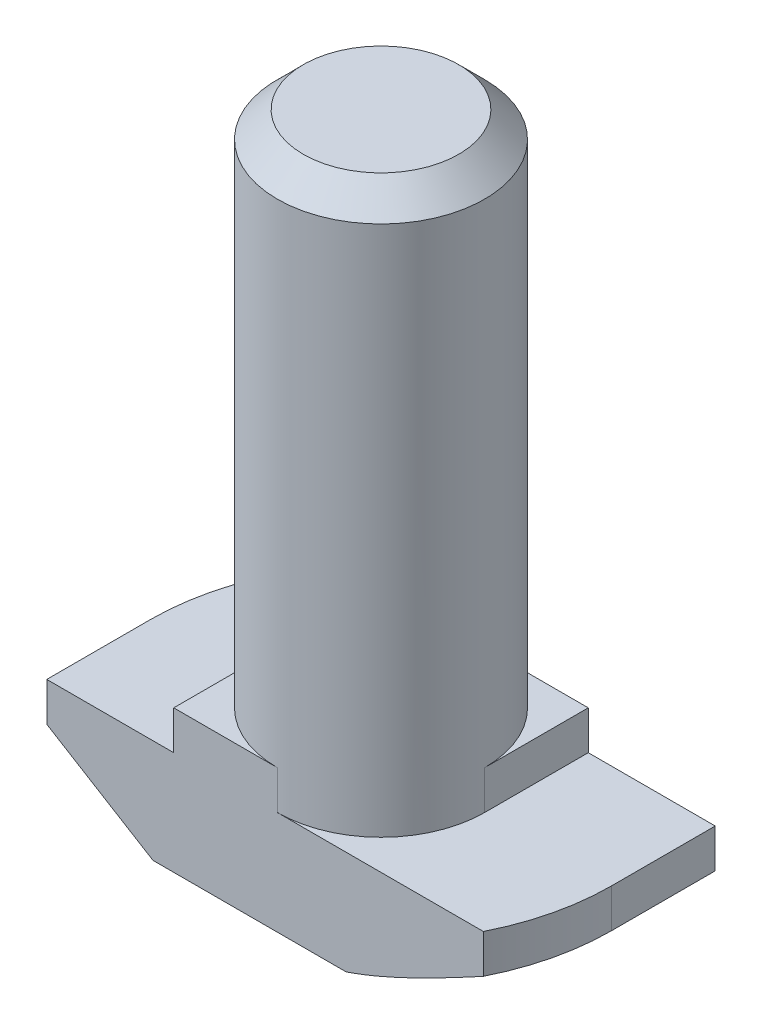
ISO-10303-21;
HEADER;
FILE_DESCRIPTION(('STEP AP214'),'2;1');
FILE_NAME('part.step','',(''),(''),'','','');
FILE_SCHEMA(('AUTOMOTIVE_DESIGN { 1 0 10303 214 1 1 1 1 }'));
ENDSEC;
DATA;
#1=APPLICATION_CONTEXT('core data for automotive mechanical design processes');
#2=APPLICATION_PROTOCOL_DEFINITION('international standard','automotive_design',2000,#1);
#3=PRODUCT_CONTEXT('',#1,'mechanical');
#4=PRODUCT('Part','Part','',(#3));
#5=PRODUCT_RELATED_PRODUCT_CATEGORY('part','',(#4));
#6=PRODUCT_DEFINITION_FORMATION('','',#4);
#7=PRODUCT_DEFINITION_CONTEXT('part definition',#1,'design');
#8=PRODUCT_DEFINITION('design','',#6,#7);
#9=PRODUCT_DEFINITION_SHAPE('','',#8);
#10=(LENGTH_UNIT() NAMED_UNIT(*) SI_UNIT(.MILLI.,.METRE.));
#11=(NAMED_UNIT(*) PLANE_ANGLE_UNIT() SI_UNIT($,.RADIAN.));
#12=(NAMED_UNIT(*) SI_UNIT($,.STERADIAN.) SOLID_ANGLE_UNIT());
#13=UNCERTAINTY_MEASURE_WITH_UNIT(LENGTH_MEASURE(1.E-05),#10,'distance_accuracy_value','');
#14=(GEOMETRIC_REPRESENTATION_CONTEXT(3) GLOBAL_UNCERTAINTY_ASSIGNED_CONTEXT((#13)) GLOBAL_UNIT_ASSIGNED_CONTEXT((#10,
#11,#12)) REPRESENTATION_CONTEXT('',''));
#15=CARTESIAN_POINT('',(0.,0.,0.));
#16=DIRECTION('',(0.,0.,1.));
#17=DIRECTION('',(1.,0.,0.));
#18=AXIS2_PLACEMENT_3D('',#15,#16,#17);
#19=CARTESIAN_POINT('',(-8.9,0.,4.));
#20=DIRECTION('',(1.,0.,0.));
#21=DIRECTION('',(0.,0.,-1.));
#22=AXIS2_PLACEMENT_3D('',#19,#20,#21);
#23=PLANE('',#22);
#24=DIRECTION('',(0.,0.,-1.));
#25=VECTOR('',#24,1.);
#26=CARTESIAN_POINT('',(-8.9,2.5,4.));
#27=LINE('',#26,#25);
#28=CARTESIAN_POINT('',(-8.9,2.5,4.));
#29=VERTEX_POINT('',#28);
#30=CARTESIAN_POINT('',(-8.9,2.5,0.));
#31=VERTEX_POINT('',#30);
#32=EDGE_CURVE('E369',#29,#31,#27,.T.);
#33=ORIENTED_EDGE('',*,*,#32,.F.);
#34=DIRECTION('',(0.,-1.,0.));
#35=VECTOR('',#34,1.);
#36=CARTESIAN_POINT('',(-8.9,0.,4.));
#37=LINE('',#36,#35);
#38=CARTESIAN_POINT('',(-8.9,4.,4.));
#39=VERTEX_POINT('',#38);
#40=EDGE_CURVE('E209',#39,#29,#37,.T.);
#41=ORIENTED_EDGE('',*,*,#40,.F.);
#42=DIRECTION('',(0.,0.,-1.));
#43=VECTOR('',#42,1.);
#44=CARTESIAN_POINT('',(-8.9,4.,4.));
#45=LINE('',#44,#43);
#46=CARTESIAN_POINT('',(-8.9,4.,0.));
#47=VERTEX_POINT('',#46);
#48=EDGE_CURVE('E224',#39,#47,#45,.T.);
#49=ORIENTED_EDGE('',*,*,#48,.T.);
#50=DIRECTION('',(0.,1.,0.));
#51=VECTOR('',#50,1.);
#52=CARTESIAN_POINT('',(-8.9,0.,0.));
#53=LINE('',#52,#51);
#54=EDGE_CURVE('E197',#31,#47,#53,.T.);
#55=ORIENTED_EDGE('',*,*,#54,.F.);
#56=EDGE_LOOP('',(#33,#41,#49,#55));
#57=FACE_BOUND('',#56,.T.);
#58=ADVANCED_FACE('F39',(#57),#23,.F.);
#59=CARTESIAN_POINT('',(8.9,0.,4.));
#60=DIRECTION('',(0.,1.,0.));
#61=DIRECTION('',(0.,0.,1.));
#62=AXIS2_PLACEMENT_3D('',#59,#60,#61);
#63=PLANE('',#62);
#64=DIRECTION('',(1.,0.,0.));
#65=VECTOR('',#64,1.);
#66=CARTESIAN_POINT('',(8.9,0.,4.));
#67=LINE('',#66,#65);
#68=CARTESIAN_POINT('',(-4.8,0.,4.));
#69=VERTEX_POINT('',#68);
#70=CARTESIAN_POINT('',(2.65329983228432,0.,4.));
#71=VERTEX_POINT('',#70);
#72=EDGE_CURVE('E212',#69,#71,#67,.T.);
#73=ORIENTED_EDGE('',*,*,#72,.F.);
#74=DIRECTION('',(0.,0.,-1.));
#75=VECTOR('',#74,1.);
#76=CARTESIAN_POINT('',(-4.8,0.,4.));
#77=LINE('',#76,#75);
#78=CARTESIAN_POINT('',(-4.8,0.,0.));
#79=VERTEX_POINT('',#78);
#80=EDGE_CURVE('E367',#69,#79,#77,.T.);
#81=ORIENTED_EDGE('',*,*,#80,.T.);
#82=CARTESIAN_POINT('',(0.,0.,0.));
#83=DIRECTION('',(0.,-1.,0.));
#84=DIRECTION('',(-1.,0.,0.));
#85=AXIS2_PLACEMENT_3D('',#82,#83,#84);
#86=CIRCLE('',#85,4.8);
#87=CARTESIAN_POINT('',(-2.65329983228432,0.,-4.));
#88=VERTEX_POINT('',#87);
#89=EDGE_CURVE('E366',#79,#88,#86,.T.);
#90=ORIENTED_EDGE('',*,*,#89,.T.);
#91=DIRECTION('',(1.,0.,0.));
#92=VECTOR('',#91,1.);
#93=CARTESIAN_POINT('',(8.9,0.,-4.));
#94=LINE('',#93,#92);
#95=CARTESIAN_POINT('',(4.8,0.,-4.));
#96=VERTEX_POINT('',#95);
#97=EDGE_CURVE('E208',#88,#96,#94,.T.);
#98=ORIENTED_EDGE('',*,*,#97,.T.);
#99=DIRECTION('',(0.,0.,1.));
#100=VECTOR('',#99,1.);
#101=CARTESIAN_POINT('',(4.8,0.,-8.9));
#102=LINE('',#101,#100);
#103=CARTESIAN_POINT('',(4.8,0.,0.));
#104=VERTEX_POINT('',#103);
#105=EDGE_CURVE('E55',#96,#104,#102,.T.);
#106=ORIENTED_EDGE('',*,*,#105,.T.);
#107=CARTESIAN_POINT('',(0.,0.,0.));
#108=DIRECTION('',(0.,-1.,0.));
#109=DIRECTION('',(1.,0.,0.));
#110=AXIS2_PLACEMENT_3D('',#107,#108,#109);
#111=CIRCLE('',#110,4.8);
#112=EDGE_CURVE('E155',#104,#71,#111,.T.);
#113=ORIENTED_EDGE('',*,*,#112,.T.);
#114=EDGE_LOOP('',(#73,#81,#90,#98,#106,#113));
#115=FACE_BOUND('',#114,.T.);
#116=ADVANCED_FACE('F270',(#115),#63,.F.);
#117=CARTESIAN_POINT('',(8.9,0.,4.));
#118=DIRECTION('',(-1.,0.,0.));
#119=DIRECTION('',(0.,0.,1.));
#120=AXIS2_PLACEMENT_3D('',#117,#118,#119);
#121=PLANE('',#120);
#122=DIRECTION('',(0.,0.,1.));
#123=VECTOR('',#122,1.);
#124=CARTESIAN_POINT('',(8.9,2.5,-8.9));
#125=LINE('',#124,#123);
#126=CARTESIAN_POINT('',(8.9,2.5,-4.));
#127=VERTEX_POINT('',#126);
#128=CARTESIAN_POINT('',(8.9,2.5,0.));
#129=VERTEX_POINT('',#128);
#130=EDGE_CURVE('E147',#127,#129,#125,.T.);
#131=ORIENTED_EDGE('',*,*,#130,.F.);
#132=DIRECTION('',(0.,1.,0.));
#133=VECTOR('',#132,1.);
#134=CARTESIAN_POINT('',(8.9,0.,-4.));
#135=LINE('',#134,#133);
#136=CARTESIAN_POINT('',(8.9,4.,-4.));
#137=VERTEX_POINT('',#136);
#138=EDGE_CURVE('E227',#127,#137,#135,.T.);
#139=ORIENTED_EDGE('',*,*,#138,.T.);
#140=DIRECTION('',(0.,0.,-1.));
#141=VECTOR('',#140,1.);
#142=CARTESIAN_POINT('',(8.9,4.,4.));
#143=LINE('',#142,#141);
#144=CARTESIAN_POINT('',(8.9,4.,0.));
#145=VERTEX_POINT('',#144);
#146=EDGE_CURVE('E175',#145,#137,#143,.T.);
#147=ORIENTED_EDGE('',*,*,#146,.F.);
#148=DIRECTION('',(0.,1.,0.));
#149=VECTOR('',#148,1.);
#150=CARTESIAN_POINT('',(8.9,0.,0.));
#151=LINE('',#150,#149);
#152=EDGE_CURVE('E168',#129,#145,#151,.T.);
#153=ORIENTED_EDGE('',*,*,#152,.F.);
#154=EDGE_LOOP('',(#131,#139,#147,#153));
#155=FACE_BOUND('',#154,.T.);
#156=ADVANCED_FACE('F173',(#155),#121,.F.);
#157=CARTESIAN_POINT('',(0.,0.,4.));
#158=DIRECTION('',(0.,0.,-1.));
#159=DIRECTION('',(-1.,0.,0.));
#160=AXIS2_PLACEMENT_3D('',#157,#158,#159);
#161=PLANE('',#160);
#162=DIRECTION('',(-0.853796175794036,0.520607424264656,0.));
#163=VECTOR('',#162,1.);
#164=CARTESIAN_POINT('',(-8.9,2.5,4.));
#165=LINE('',#164,#163);
#166=EDGE_CURVE('E375',#69,#29,#165,.T.);
#167=ORIENTED_EDGE('',*,*,#166,.F.);
#168=ORIENTED_EDGE('',*,*,#72,.T.);
#169=CARTESIAN_POINT('',(7.95117168412038,2.5003812948523,4.));
#170=CARTESIAN_POINT('',(7.73552594180779,2.38294262104349,4.));
#171=CARTESIAN_POINT('',(7.51949196287052,2.26620761305275,4.));
#172=CARTESIAN_POINT('',(7.08640702943254,2.03458295404349,4.));
#173=CARTESIAN_POINT('',(6.86935596494317,1.91969350884632,4.));
#174=CARTESIAN_POINT('',(6.43326841812792,1.6918189237928,4.));
#175=CARTESIAN_POINT('',(6.21422761700308,1.57884202880893,4.));
#176=CARTESIAN_POINT('',(5.77463734455681,1.3558784061402,4.));
#177=CARTESIAN_POINT('',(5.55408794028136,1.24589154663778,4.));
#178=CARTESIAN_POINT('',(5.11647910281973,1.03243373636638,4.));
#179=CARTESIAN_POINT('',(4.89946541196746,0.92886934419743,4.));
#180=CARTESIAN_POINT('',(4.46314517755054,0.726599943828819,4.));
#181=CARTESIAN_POINT('',(4.24383839666258,0.627895444761259,4.));
#182=CARTESIAN_POINT('',(3.80261128872497,0.437105119516572,4.));
#183=CARTESIAN_POINT('',(3.5806938708347,0.345012613183118,4.));
#184=CARTESIAN_POINT('',(3.13341004119999,0.169681531704238,4.));
#185=CARTESIAN_POINT('',(2.90804453781551,0.0864406691133928,4.));
#186=CARTESIAN_POINT('',(2.46564049107812,-0.0637337384147157,4.));
#187=CARTESIAN_POINT('',(2.24882314531661,-0.131311270143758,4.));
#188=CARTESIAN_POINT('',(1.81134539093152,-0.252017085141675,4.));
#189=CARTESIAN_POINT('',(1.59068966949939,-0.305161832872051,4.));
#190=CARTESIAN_POINT('',(1.25578974895032,-0.37125386899099,4.));
#191=CARTESIAN_POINT('',(1.1428915032614,-0.391082257285261,4.));
#192=CARTESIAN_POINT('',(0.916303642162891,-0.425522742673794,4.));
#193=CARTESIAN_POINT('',(0.802614110911478,-0.440135386106777,4.));
#194=CARTESIAN_POINT('',(0.574171741878051,-0.463762938801405,4.));
#195=CARTESIAN_POINT('',(0.459416448807066,-0.472754337723224,4.));
#196=CARTESIAN_POINT('',(0.229544837125645,-0.484799371089924,4.));
#197=CARTESIAN_POINT('',(0.11442837922421,-0.487850330163754,4.));
#198=CARTESIAN_POINT('',(-0.000700000000000364,-0.487804840701222,4.));
#199=B_SPLINE_CURVE_WITH_KNOTS('',3,(#169,#170,#171,#172,#173,#174,#175,#176,#177,#178,#179,
#180,#181,#182,#183,#184,#185,#186,#187,#188,#189,#190,#191,#192,#193,#194,#195,#196,#197,#198),
.UNSPECIFIED.,.F.,.F.,(4,2,2,2,2,2,2,2,2,2,2,2,2,2,4),(0.,0.73665607857229,1.47339374819651,
2.212756769811,2.95208714311461,3.6734194697194,4.39482720444832,5.11549552795205,
5.83597716113291,6.51694414905028,7.19713101684283,7.54090798827143,7.88464893918285,
8.22981810256985,8.57514268242548),.UNSPECIFIED.);
#200=CARTESIAN_POINT('',(7.95047168412038,2.5,4.));
#201=VERTEX_POINT('',#200);
#202=EDGE_CURVE('E319',#201,#71,#199,.T.);
#203=ORIENTED_EDGE('',*,*,#202,.F.);
#204=DIRECTION('',(0.,1.,0.));
#205=VECTOR('',#204,1.);
#206=CARTESIAN_POINT('',(7.95047168412038,0.,4.));
#207=LINE('',#206,#205);
#208=CARTESIAN_POINT('',(7.95047168412038,4.,4.));
#209=VERTEX_POINT('',#208);
#210=EDGE_CURVE('E170',#201,#209,#207,.T.);
#211=ORIENTED_EDGE('',*,*,#210,.T.);
#212=DIRECTION('',(-1.,0.,0.));
#213=VECTOR('',#212,1.);
#214=CARTESIAN_POINT('',(8.9,4.,4.));
#215=LINE('',#214,#213);
#216=CARTESIAN_POINT('',(0.,4.,4.));
#217=VERTEX_POINT('',#216);
#218=EDGE_CURVE('E216',#209,#217,#215,.T.);
#219=ORIENTED_EDGE('',*,*,#218,.T.);
#220=DIRECTION('',(0.,1.,0.));
#221=VECTOR('',#220,1.);
#222=CARTESIAN_POINT('',(0.,-1.65685424949238,4.));
#223=LINE('',#222,#221);
#224=CARTESIAN_POINT('',(0.,5.5,4.));
#225=VERTEX_POINT('',#224);
#226=EDGE_CURVE('E193',#217,#225,#223,.T.);
#227=ORIENTED_EDGE('',*,*,#226,.T.);
#228=DIRECTION('',(-1.,0.,0.));
#229=VECTOR('',#228,1.);
#230=CARTESIAN_POINT('',(-4.,5.5,4.));
#231=LINE('',#230,#229);
#232=CARTESIAN_POINT('',(-4.,5.5,4.));
#233=VERTEX_POINT('',#232);
#234=EDGE_CURVE('E218',#225,#233,#231,.T.);
#235=ORIENTED_EDGE('',*,*,#234,.T.);
#236=DIRECTION('',(0.,-1.,0.));
#237=VECTOR('',#236,1.);
#238=CARTESIAN_POINT('',(-4.,4.,4.));
#239=LINE('',#238,#237);
#240=CARTESIAN_POINT('',(-4.,4.,4.));
#241=VERTEX_POINT('',#240);
#242=EDGE_CURVE('E220',#233,#241,#239,.T.);
#243=ORIENTED_EDGE('',*,*,#242,.T.);
#244=DIRECTION('',(-1.,0.,0.));
#245=VECTOR('',#244,1.);
#246=CARTESIAN_POINT('',(-8.9,4.,4.));
#247=LINE('',#246,#245);
#248=EDGE_CURVE('E222',#241,#39,#247,.T.);
#249=ORIENTED_EDGE('',*,*,#248,.T.);
#250=ORIENTED_EDGE('',*,*,#40,.T.);
#251=EDGE_LOOP('',(#167,#168,#203,#211,#219,#227,#235,#243,#249,#250));
#252=FACE_BOUND('',#251,.T.);
#253=ADVANCED_FACE('F281',(#252),#161,.F.);
#254=CARTESIAN_POINT('',(0.,0.,-4.));
#255=DIRECTION('',(0.,0.,-1.));
#256=DIRECTION('',(-1.,0.,0.));
#257=AXIS2_PLACEMENT_3D('',#254,#255,#256);
#258=PLANE('',#257);
#259=ORIENTED_EDGE('',*,*,#97,.F.);
#260=CARTESIAN_POINT('',(0.000700000000000375,-0.487804840701222,-4.));
#261=CARTESIAN_POINT('',(-0.0911783891396318,-0.48782848460975,-4.));
#262=CARTESIAN_POINT('',(-0.183052746172593,-0.485894534221646,-4.));
#263=CARTESIAN_POINT('',(-0.366624394777082,-0.478214110158694,-4.));
#264=CARTESIAN_POINT('',(-0.458321717815279,-0.472468391698149,-4.));
#265=CARTESIAN_POINT('',(-0.641197389589646,-0.457284413495929,-4.));
#266=CARTESIAN_POINT('',(-0.732376445680467,-0.447854631312074,-4.));
#267=CARTESIAN_POINT('',(-0.914302231773763,-0.425490539884402,-4.));
#268=CARTESIAN_POINT('',(-1.00504894282095,-0.41255607839799,-4.));
#269=CARTESIAN_POINT('',(-1.27475669839242,-0.369111241216707,-4.));
#270=CARTESIAN_POINT('',(-1.45295798960378,-0.333803642672856,-4.));
#271=CARTESIAN_POINT('',(-1.80688694554488,-0.252374259841994,-4.));
#272=CARTESIAN_POINT('',(-1.98261350049563,-0.206247777936689,-4.));
#273=CARTESIAN_POINT('',(-2.40843477616905,-0.0830176290147687,-4.));
#274=CARTESIAN_POINT('',(-2.65716286909735,-0.00122224492027907,-4.));
#275=CARTESIAN_POINT('',(-3.1500236667871,0.175317023068226,-4.));
#276=CARTESIAN_POINT('',(-3.39415374276215,0.270068072754652,-4.));
#277=CARTESIAN_POINT('',(-3.87928874246701,0.469058436828284,-4.));
#278=CARTESIAN_POINT('',(-4.12028285320838,0.573323871149427,-4.));
#279=CARTESIAN_POINT('',(-4.59919632282166,0.788504405818799,-4.));
#280=CARTESIAN_POINT('',(-4.83711633279242,0.899418069039211,-4.));
#281=CARTESIAN_POINT('',(-5.31822851183188,1.1297988974704,-4.));
#282=CARTESIAN_POINT('',(-5.56134348218909,1.24942652452964,-4.));
#283=CARTESIAN_POINT('',(-6.045636996258,1.49257282867588,-4.));
#284=CARTESIAN_POINT('',(-6.28681538137222,1.61609182045058,-4.));
#285=CARTESIAN_POINT('',(-6.76588702271679,1.86515627626158,-4.));
#286=CARTESIAN_POINT('',(-7.0037914098582,1.99068039524177,-4.));
#287=CARTESIAN_POINT('',(-7.47834127800901,2.24398618358021,-4.));
#288=CARTESIAN_POINT('',(-7.71498697875761,2.37176744085524,-4.));
#289=CARTESIAN_POINT('',(-7.95117168412038,2.50038129485229,-4.));
#290=B_SPLINE_CURVE_WITH_KNOTS('',3,(#260,#261,#262,#263,#264,#265,#266,#267,#268,#269,#270,
#271,#272,#273,#274,#275,#276,#277,#278,#279,#280,#281,#282,#283,#284,#285,#286,#287,#288,#289),
.UNSPECIFIED.,.F.,.F.,(4,2,2,2,2,2,2,2,2,2,2,2,2,2,4),(0.,0.275607667670162,0.551160746311937,
0.82608343769266,1.10101807357745,1.64556230190507,2.19034341346489,2.97528858833922,
3.76066968678114,4.54827578228531,5.33571223306797,6.14852584679743,6.96140536089395,
7.76835733370051,8.57516347444109),.UNSPECIFIED.);
#291=CARTESIAN_POINT('',(-7.95047168412038,2.5,-4.));
#292=VERTEX_POINT('',#291);
#293=EDGE_CURVE('E313',#88,#292,#290,.T.);
#294=ORIENTED_EDGE('',*,*,#293,.T.);
#295=DIRECTION('',(0.,1.,0.));
#296=VECTOR('',#295,1.);
#297=CARTESIAN_POINT('',(-7.95047168412038,0.,-4.));
#298=LINE('',#297,#296);
#299=CARTESIAN_POINT('',(-7.95047168412038,4.,-4.));
#300=VERTEX_POINT('',#299);
#301=EDGE_CURVE('E179',#292,#300,#298,.T.);
#302=ORIENTED_EDGE('',*,*,#301,.T.);
#303=DIRECTION('',(-1.,0.,0.));
#304=VECTOR('',#303,1.);
#305=CARTESIAN_POINT('',(-8.9,4.,-4.));
#306=LINE('',#305,#304);
#307=CARTESIAN_POINT('',(0.,4.,-4.));
#308=VERTEX_POINT('',#307);
#309=EDGE_CURVE('E213',#308,#300,#306,.T.);
#310=ORIENTED_EDGE('',*,*,#309,.F.);
#311=DIRECTION('',(0.,1.,0.));
#312=VECTOR('',#311,1.);
#313=CARTESIAN_POINT('',(0.,-1.65685424949238,-4.));
#314=LINE('',#313,#312);
#315=CARTESIAN_POINT('',(0.,5.5,-4.));
#316=VERTEX_POINT('',#315);
#317=EDGE_CURVE('E204',#308,#316,#314,.T.);
#318=ORIENTED_EDGE('',*,*,#317,.T.);
#319=DIRECTION('',(-1.,0.,0.));
#320=VECTOR('',#319,1.);
#321=CARTESIAN_POINT('',(-4.,5.5,-4.));
#322=LINE('',#321,#320);
#323=CARTESIAN_POINT('',(4.,5.5,-4.));
#324=VERTEX_POINT('',#323);
#325=EDGE_CURVE('E235',#324,#316,#322,.T.);
#326=ORIENTED_EDGE('',*,*,#325,.F.);
#327=DIRECTION('',(0.,1.,0.));
#328=VECTOR('',#327,1.);
#329=CARTESIAN_POINT('',(4.,4.,-4.));
#330=LINE('',#329,#328);
#331=CARTESIAN_POINT('',(4.,4.,-4.));
#332=VERTEX_POINT('',#331);
#333=EDGE_CURVE('E232',#332,#324,#330,.T.);
#334=ORIENTED_EDGE('',*,*,#333,.F.);
#335=DIRECTION('',(-1.,0.,0.));
#336=VECTOR('',#335,1.);
#337=CARTESIAN_POINT('',(8.9,4.,-4.));
#338=LINE('',#337,#336);
#339=EDGE_CURVE('E229',#137,#332,#338,.T.);
#340=ORIENTED_EDGE('',*,*,#339,.F.);
#341=ORIENTED_EDGE('',*,*,#138,.F.);
#342=DIRECTION('',(-0.853796175794036,-0.520607424264656,0.));
#343=VECTOR('',#342,1.);
#344=CARTESIAN_POINT('',(1.3009540329575,-2.13356461405031,-4.));
#345=LINE('',#344,#343);
#346=EDGE_CURVE('E151',#127,#96,#345,.T.);
#347=ORIENTED_EDGE('',*,*,#346,.T.);
#348=EDGE_LOOP('',(#259,#294,#302,#310,#318,#326,#334,#340,#341,#347));
#349=FACE_BOUND('',#348,.T.);
#350=ADVANCED_FACE('F304',(#349),#258,.T.);
#351=CARTESIAN_POINT('',(0.,0.,0.));
#352=DIRECTION('',(0.,1.,0.));
#353=DIRECTION('',(0.,0.,1.));
#354=AXIS2_PLACEMENT_3D('',#351,#352,#353);
#355=CYLINDRICAL_SURFACE('',#354,8.9);
#356=CARTESIAN_POINT('',(0.,2.5,0.));
#357=DIRECTION('',(0.,-1.,0.));
#358=DIRECTION('',(-1.,0.,0.));
#359=AXIS2_PLACEMENT_3D('',#356,#357,#358);
#360=CIRCLE('',#359,8.9);
#361=EDGE_CURVE('E63',#31,#292,#360,.T.);
#362=ORIENTED_EDGE('',*,*,#361,.F.);
#363=ORIENTED_EDGE('',*,*,#54,.T.);
#364=CARTESIAN_POINT('',(0.,4.,0.));
#365=DIRECTION('',(0.,-1.,0.));
#366=DIRECTION('',(0.,0.,-1.));
#367=AXIS2_PLACEMENT_3D('',#364,#365,#366);
#368=CIRCLE('',#367,8.9);
#369=EDGE_CURVE('E176',#47,#300,#368,.T.);
#370=ORIENTED_EDGE('',*,*,#369,.T.);
#371=ORIENTED_EDGE('',*,*,#301,.F.);
#372=EDGE_LOOP('',(#362,#363,#370,#371));
#373=FACE_BOUND('',#372,.T.);
#374=ADVANCED_FACE('F308',(#373),#355,.T.);
#375=CARTESIAN_POINT('',(0.,0.,0.));
#376=DIRECTION('',(0.,1.,0.));
#377=DIRECTION('',(0.,0.,1.));
#378=AXIS2_PLACEMENT_3D('',#375,#376,#377);
#379=CYLINDRICAL_SURFACE('',#378,8.9);
#380=CARTESIAN_POINT('',(0.,2.5,0.));
#381=DIRECTION('',(0.,-1.,0.));
#382=DIRECTION('',(1.,0.,0.));
#383=AXIS2_PLACEMENT_3D('',#380,#381,#382);
#384=CIRCLE('',#383,8.9);
#385=EDGE_CURVE('E160',#129,#201,#384,.T.);
#386=ORIENTED_EDGE('',*,*,#385,.F.);
#387=ORIENTED_EDGE('',*,*,#152,.T.);
#388=CARTESIAN_POINT('',(0.,4.,0.));
#389=DIRECTION('',(0.,-1.,0.));
#390=DIRECTION('',(0.,0.,-1.));
#391=AXIS2_PLACEMENT_3D('',#388,#389,#390);
#392=CIRCLE('',#391,8.9);
#393=EDGE_CURVE('E181',#145,#209,#392,.T.);
#394=ORIENTED_EDGE('',*,*,#393,.T.);
#395=ORIENTED_EDGE('',*,*,#210,.F.);
#396=EDGE_LOOP('',(#386,#387,#394,#395));
#397=FACE_BOUND('',#396,.T.);
#398=ADVANCED_FACE('F166',(#397),#379,.T.);
#399=CARTESIAN_POINT('',(-4.,5.5,4.));
#400=DIRECTION('',(0.,-1.,0.));
#401=DIRECTION('',(0.,0.,-1.));
#402=AXIS2_PLACEMENT_3D('',#399,#400,#401);
#403=PLANE('',#402);
#404=CARTESIAN_POINT('',(0.,5.5,0.));
#405=DIRECTION('',(0.,1.,0.));
#406=DIRECTION('',(0.,0.,1.));
#407=AXIS2_PLACEMENT_3D('',#404,#405,#406);
#408=CIRCLE('',#407,4.);
#409=CARTESIAN_POINT('',(4.,5.5,0.));
#410=VERTEX_POINT('',#409);
#411=EDGE_CURVE('E186',#410,#316,#408,.T.);
#412=ORIENTED_EDGE('',*,*,#411,.F.);
#413=DIRECTION('',(0.,0.,-1.));
#414=VECTOR('',#413,1.);
#415=CARTESIAN_POINT('',(4.,5.5,4.));
#416=LINE('',#415,#414);
#417=EDGE_CURVE('E248',#410,#324,#416,.T.);
#418=ORIENTED_EDGE('',*,*,#417,.T.);
#419=ORIENTED_EDGE('',*,*,#325,.T.);
#420=EDGE_LOOP('',(#412,#418,#419));
#421=FACE_BOUND('',#420,.T.);
#422=ADVANCED_FACE('F294',(#421),#403,.F.);
#423=CARTESIAN_POINT('',(-4.,5.5,0.));
#424=VERTEX_POINT('',#423);
#425=EDGE_CURVE('E189',#424,#225,#408,.T.);
#426=ORIENTED_EDGE('',*,*,#425,.F.);
#427=DIRECTION('',(0.,0.,-1.));
#428=VECTOR('',#427,1.);
#429=CARTESIAN_POINT('',(-4.,5.5,4.));
#430=LINE('',#429,#428);
#431=EDGE_CURVE('E245',#233,#424,#430,.T.);
#432=ORIENTED_EDGE('',*,*,#431,.F.);
#433=ORIENTED_EDGE('',*,*,#234,.F.);
#434=EDGE_LOOP('',(#426,#432,#433));
#435=FACE_BOUND('',#434,.T.);
#436=ADVANCED_FACE('F286',(#435),#403,.F.);
#437=CARTESIAN_POINT('',(8.9,4.,4.));
#438=DIRECTION('',(0.,-1.,0.));
#439=DIRECTION('',(0.,0.,-1.));
#440=AXIS2_PLACEMENT_3D('',#437,#438,#439);
#441=PLANE('',#440);
#442=ORIENTED_EDGE('',*,*,#218,.F.);
#443=ORIENTED_EDGE('',*,*,#393,.F.);
#444=ORIENTED_EDGE('',*,*,#146,.T.);
#445=ORIENTED_EDGE('',*,*,#339,.T.);
#446=DIRECTION('',(0.,0.,-1.));
#447=VECTOR('',#446,1.);
#448=CARTESIAN_POINT('',(4.,4.,4.));
#449=LINE('',#448,#447);
#450=CARTESIAN_POINT('',(4.,4.,0.));
#451=VERTEX_POINT('',#450);
#452=EDGE_CURVE('E250',#451,#332,#449,.T.);
#453=ORIENTED_EDGE('',*,*,#452,.F.);
#454=CARTESIAN_POINT('',(0.,4.,0.));
#455=DIRECTION('',(0.,-1.,0.));
#456=DIRECTION('',(0.,0.,-1.));
#457=AXIS2_PLACEMENT_3D('',#454,#455,#456);
#458=CIRCLE('',#457,4.);
#459=EDGE_CURVE('E190',#451,#217,#458,.T.);
#460=ORIENTED_EDGE('',*,*,#459,.T.);
#461=EDGE_LOOP('',(#442,#443,#444,#445,#453,#460));
#462=FACE_BOUND('',#461,.T.);
#463=ADVANCED_FACE('F282',(#462),#441,.F.);
#464=CARTESIAN_POINT('',(4.,4.,4.));
#465=DIRECTION('',(-1.,0.,0.));
#466=DIRECTION('',(0.,0.,1.));
#467=AXIS2_PLACEMENT_3D('',#464,#465,#466);
#468=PLANE('',#467);
#469=ORIENTED_EDGE('',*,*,#417,.F.);
#470=DIRECTION('',(0.,1.,0.));
#471=VECTOR('',#470,1.);
#472=CARTESIAN_POINT('',(4.,-1.65685424949238,0.));
#473=LINE('',#472,#471);
#474=EDGE_CURVE('E194',#451,#410,#473,.T.);
#475=ORIENTED_EDGE('',*,*,#474,.F.);
#476=ORIENTED_EDGE('',*,*,#452,.T.);
#477=ORIENTED_EDGE('',*,*,#333,.T.);
#478=EDGE_LOOP('',(#469,#475,#476,#477));
#479=FACE_BOUND('',#478,.T.);
#480=ADVANCED_FACE('F285',(#479),#468,.F.);
#481=CARTESIAN_POINT('',(-4.,4.,4.));
#482=DIRECTION('',(1.,0.,0.));
#483=DIRECTION('',(0.,0.,-1.));
#484=AXIS2_PLACEMENT_3D('',#481,#482,#483);
#485=PLANE('',#484);
#486=ORIENTED_EDGE('',*,*,#431,.T.);
#487=DIRECTION('',(0.,1.,0.));
#488=VECTOR('',#487,1.);
#489=CARTESIAN_POINT('',(-4.,-1.65685424949238,0.));
#490=LINE('',#489,#488);
#491=CARTESIAN_POINT('',(-4.,4.,0.));
#492=VERTEX_POINT('',#491);
#493=EDGE_CURVE('E200',#492,#424,#490,.T.);
#494=ORIENTED_EDGE('',*,*,#493,.F.);
#495=DIRECTION('',(0.,0.,-1.));
#496=VECTOR('',#495,1.);
#497=CARTESIAN_POINT('',(-4.,4.,4.));
#498=LINE('',#497,#496);
#499=EDGE_CURVE('E242',#241,#492,#498,.T.);
#500=ORIENTED_EDGE('',*,*,#499,.F.);
#501=ORIENTED_EDGE('',*,*,#242,.F.);
#502=EDGE_LOOP('',(#486,#494,#500,#501));
#503=FACE_BOUND('',#502,.T.);
#504=ADVANCED_FACE('F290',(#503),#485,.F.);
#505=CARTESIAN_POINT('',(-8.9,4.,4.));
#506=DIRECTION('',(0.,-1.,0.));
#507=DIRECTION('',(0.,0.,-1.));
#508=AXIS2_PLACEMENT_3D('',#505,#506,#507);
#509=PLANE('',#508);
#510=ORIENTED_EDGE('',*,*,#309,.T.);
#511=ORIENTED_EDGE('',*,*,#369,.F.);
#512=ORIENTED_EDGE('',*,*,#48,.F.);
#513=ORIENTED_EDGE('',*,*,#248,.F.);
#514=ORIENTED_EDGE('',*,*,#499,.T.);
#515=CARTESIAN_POINT('',(0.,4.,0.));
#516=DIRECTION('',(0.,-1.,0.));
#517=DIRECTION('',(0.,0.,-1.));
#518=AXIS2_PLACEMENT_3D('',#515,#516,#517);
#519=CIRCLE('',#518,4.);
#520=EDGE_CURVE('E201',#492,#308,#519,.T.);
#521=ORIENTED_EDGE('',*,*,#520,.T.);
#522=EDGE_LOOP('',(#510,#511,#512,#513,#514,#521));
#523=FACE_BOUND('',#522,.T.);
#524=ADVANCED_FACE('F298',(#523),#509,.F.);
#525=CARTESIAN_POINT('',(0.,-1.65685424949238,0.));
#526=DIRECTION('',(0.,1.,0.));
#527=DIRECTION('',(0.,0.,1.));
#528=AXIS2_PLACEMENT_3D('',#525,#526,#527);
#529=CYLINDRICAL_SURFACE('',#528,4.);
#530=CARTESIAN_POINT('',(0.,24.5,0.));
#531=DIRECTION('',(0.,1.,0.));
#532=DIRECTION('',(0.,0.,1.));
#533=AXIS2_PLACEMENT_3D('',#530,#531,#532);
#534=CIRCLE('',#533,4.);
#535=CARTESIAN_POINT('',(0.,24.5,4.));
#536=VERTEX_POINT('',#535);
#537=EDGE_CURVE('E11',#536,#536,#534,.F.);
#538=ORIENTED_EDGE('',*,*,#537,.T.);
#539=EDGE_LOOP('',(#538));
#540=FACE_BOUND('',#539,.T.);
#541=ORIENTED_EDGE('',*,*,#474,.T.);
#542=ORIENTED_EDGE('',*,*,#411,.T.);
#543=ORIENTED_EDGE('',*,*,#317,.F.);
#544=ORIENTED_EDGE('',*,*,#520,.F.);
#545=ORIENTED_EDGE('',*,*,#493,.T.);
#546=ORIENTED_EDGE('',*,*,#425,.T.);
#547=ORIENTED_EDGE('',*,*,#226,.F.);
#548=ORIENTED_EDGE('',*,*,#459,.F.);
#549=EDGE_LOOP('',(#541,#542,#543,#544,#545,#546,#547,#548));
#550=FACE_BOUND('',#549,.T.);
#551=ADVANCED_FACE('F302',(#540,#550),#529,.T.);
#552=CARTESIAN_POINT('',(0.,25.5,0.));
#553=DIRECTION('',(0.,1.,0.));
#554=DIRECTION('',(0.,0.,1.));
#555=AXIS2_PLACEMENT_3D('',#552,#553,#554);
#556=PLANE('',#555);
#557=CARTESIAN_POINT('',(0.,25.5,0.));
#558=DIRECTION('',(0.,1.,0.));
#559=DIRECTION('',(0.,0.,1.));
#560=AXIS2_PLACEMENT_3D('',#557,#558,#559);
#561=CIRCLE('',#560,2.99999999999999);
#562=CARTESIAN_POINT('',(0.,25.5,2.99999999999999));
#563=VERTEX_POINT('',#562);
#564=EDGE_CURVE('E48',#563,#563,#561,.T.);
#565=ORIENTED_EDGE('',*,*,#564,.T.);
#566=EDGE_LOOP('',(#565));
#567=FACE_BOUND('',#566,.T.);
#568=ADVANCED_FACE('F255',(#567),#556,.T.);
#569=CARTESIAN_POINT('',(8.9,2.5,-8.9));
#570=DIRECTION('',(0.520607424264656,-0.853796175794036,0.));
#571=DIRECTION('',(0.853796175794036,0.520607424264656,0.));
#572=AXIS2_PLACEMENT_3D('',#569,#570,#571);
#573=PLANE('',#572);
#574=ORIENTED_EDGE('',*,*,#130,.T.);
#575=DIRECTION('',(0.853796175794036,0.520607424264656,0.));
#576=VECTOR('',#575,1.);
#577=CARTESIAN_POINT('',(8.9,2.5,0.));
#578=LINE('',#577,#576);
#579=EDGE_CURVE('E150',#104,#129,#578,.T.);
#580=ORIENTED_EDGE('',*,*,#579,.F.);
#581=ORIENTED_EDGE('',*,*,#105,.F.);
#582=ORIENTED_EDGE('',*,*,#346,.F.);
#583=EDGE_LOOP('',(#574,#580,#581,#582));
#584=FACE_BOUND('',#583,.T.);
#585=ADVANCED_FACE('F149',(#584),#573,.T.);
#586=CARTESIAN_POINT('',(0.,0.,0.));
#587=DIRECTION('',(0.,1.,0.));
#588=DIRECTION('',(0.,0.,1.));
#589=AXIS2_PLACEMENT_3D('',#586,#587,#588);
#590=CONICAL_SURFACE('',#589,4.8,1.0232340908549);
#591=ORIENTED_EDGE('',*,*,#202,.T.);
#592=ORIENTED_EDGE('',*,*,#112,.F.);
#593=ORIENTED_EDGE('',*,*,#579,.T.);
#594=ORIENTED_EDGE('',*,*,#385,.T.);
#595=EDGE_LOOP('',(#591,#592,#593,#594));
#596=FACE_BOUND('',#595,.T.);
#597=ADVANCED_FACE('F159',(#596),#590,.T.);
#598=CARTESIAN_POINT('',(-8.9,2.5,4.));
#599=DIRECTION('',(-0.520607424264656,-0.853796175794036,0.));
#600=DIRECTION('',(0.853796175794036,-0.520607424264656,0.));
#601=AXIS2_PLACEMENT_3D('',#598,#599,#600);
#602=PLANE('',#601);
#603=ORIENTED_EDGE('',*,*,#32,.T.);
#604=DIRECTION('',(-0.853796175794036,0.520607424264656,0.));
#605=VECTOR('',#604,1.);
#606=CARTESIAN_POINT('',(-8.9,2.5,0.));
#607=LINE('',#606,#605);
#608=EDGE_CURVE('E372',#79,#31,#607,.T.);
#609=ORIENTED_EDGE('',*,*,#608,.F.);
#610=ORIENTED_EDGE('',*,*,#80,.F.);
#611=ORIENTED_EDGE('',*,*,#166,.T.);
#612=EDGE_LOOP('',(#603,#609,#610,#611));
#613=FACE_BOUND('',#612,.T.);
#614=ADVANCED_FACE('F260',(#613),#602,.T.);
#615=CARTESIAN_POINT('',(0.,0.,0.));
#616=DIRECTION('',(0.,1.,0.));
#617=DIRECTION('',(0.,0.,1.));
#618=AXIS2_PLACEMENT_3D('',#615,#616,#617);
#619=CONICAL_SURFACE('',#618,4.8,1.0232340908549);
#620=ORIENTED_EDGE('',*,*,#89,.F.);
#621=ORIENTED_EDGE('',*,*,#608,.T.);
#622=ORIENTED_EDGE('',*,*,#361,.T.);
#623=ORIENTED_EDGE('',*,*,#293,.F.);
#624=EDGE_LOOP('',(#620,#621,#622,#623));
#625=FACE_BOUND('',#624,.T.);
#626=ADVANCED_FACE('F258',(#625),#619,.T.);
#627=CARTESIAN_POINT('',(0.,25.5,0.));
#628=DIRECTION('',(0.,-1.,0.));
#629=DIRECTION('',(0.,0.,-1.));
#630=AXIS2_PLACEMENT_3D('',#627,#628,#629);
#631=CONICAL_SURFACE('',#630,2.99999999999999,0.785398163397448);
#632=ORIENTED_EDGE('',*,*,#537,.F.);
#633=EDGE_LOOP('',(#632));
#634=FACE_BOUND('',#633,.T.);
#635=ORIENTED_EDGE('',*,*,#564,.F.);
#636=EDGE_LOOP('',(#635));
#637=FACE_BOUND('',#636,.T.);
#638=ADVANCED_FACE('F42',(#634,#637),#631,.T.);
#639=CLOSED_SHELL('',(#58,#116,#156,#253,#350,#374,#398,#422,#436,#463,#480,#504,#524,#551,#568,
#585,#597,#614,#626,#638));
#640=MANIFOLD_SOLID_BREP('B2',#639);
#641=ADVANCED_BREP_SHAPE_REPRESENTATION('',(#18,#640),#14);
#642=SHAPE_DEFINITION_REPRESENTATION(#9,#641);
ENDSEC;
END-ISO-10303-21;
